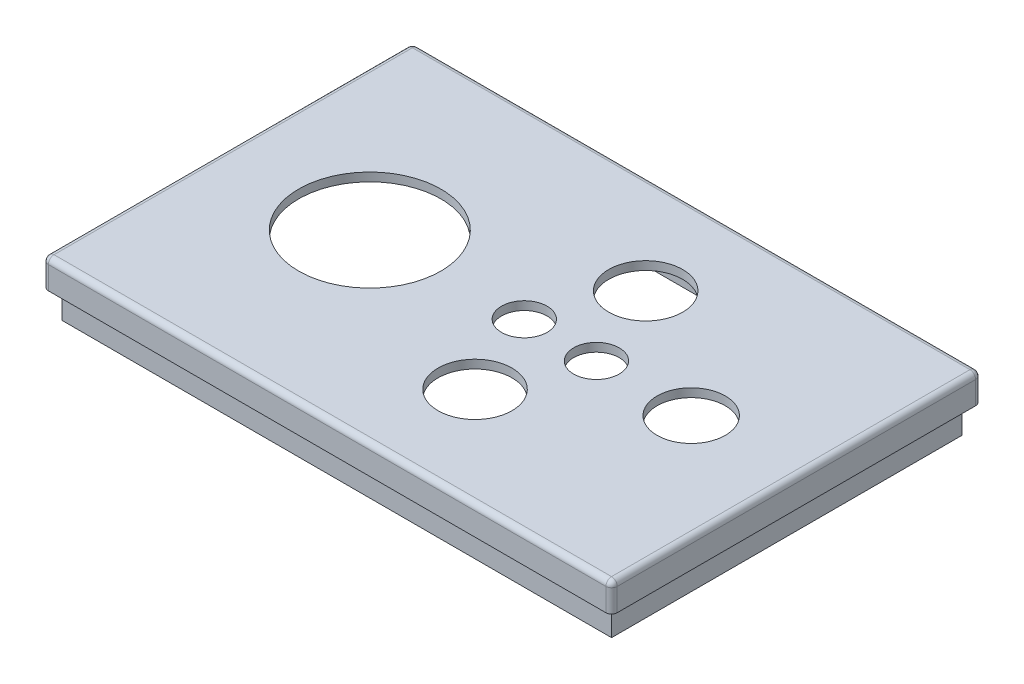
ISO-10303-21;
HEADER;
FILE_DESCRIPTION(('STEP AP214'),'2;1');
FILE_NAME('part.step','',(''),(''),'','','');
FILE_SCHEMA(('AUTOMOTIVE_DESIGN { 1 0 10303 214 1 1 1 1 }'));
ENDSEC;
DATA;
#1=APPLICATION_CONTEXT('core data for automotive mechanical design processes');
#2=APPLICATION_PROTOCOL_DEFINITION('international standard','automotive_design',2000,#1);
#3=PRODUCT_CONTEXT('',#1,'mechanical');
#4=PRODUCT('Part','Part','',(#3));
#5=PRODUCT_RELATED_PRODUCT_CATEGORY('part','',(#4));
#6=PRODUCT_DEFINITION_FORMATION('','',#4);
#7=PRODUCT_DEFINITION_CONTEXT('part definition',#1,'design');
#8=PRODUCT_DEFINITION('design','',#6,#7);
#9=PRODUCT_DEFINITION_SHAPE('','',#8);
#10=(LENGTH_UNIT() NAMED_UNIT(*) SI_UNIT(.MILLI.,.METRE.));
#11=(NAMED_UNIT(*) PLANE_ANGLE_UNIT() SI_UNIT($,.RADIAN.));
#12=(NAMED_UNIT(*) SI_UNIT($,.STERADIAN.) SOLID_ANGLE_UNIT());
#13=UNCERTAINTY_MEASURE_WITH_UNIT(LENGTH_MEASURE(1.E-05),#10,'distance_accuracy_value','');
#14=(GEOMETRIC_REPRESENTATION_CONTEXT(3) GLOBAL_UNCERTAINTY_ASSIGNED_CONTEXT((#13)) GLOBAL_UNIT_ASSIGNED_CONTEXT((#10,
#11,#12)) REPRESENTATION_CONTEXT('',''));
#15=CARTESIAN_POINT('',(0.,0.,0.));
#16=DIRECTION('',(0.,0.,1.));
#17=DIRECTION('',(1.,0.,0.));
#18=AXIS2_PLACEMENT_3D('',#15,#16,#17);
#19=CARTESIAN_POINT('',(0.,75.,0.));
#20=DIRECTION('',(0.,1.,0.));
#21=DIRECTION('',(0.,0.,1.));
#22=AXIS2_PLACEMENT_3D('',#19,#20,#21);
#23=PLANE('',#22);
#24=DIRECTION('',(-1.,0.,0.));
#25=VECTOR('',#24,1.);
#26=CARTESIAN_POINT('',(-47.0604562737643,75.,-41.1555133079848));
#27=LINE('',#26,#25);
#28=CARTESIAN_POINT('',(49.5395437262358,75.,-41.1555133079848));
#29=VERTEX_POINT('',#28);
#30=CARTESIAN_POINT('',(-47.0604562737643,75.,-41.1555133079848));
#31=VERTEX_POINT('',#30);
#32=EDGE_CURVE('E201',#29,#31,#27,.T.);
#33=ORIENTED_EDGE('',*,*,#32,.T.);
#34=DIRECTION('',(0.,0.,1.));
#35=VECTOR('',#34,1.);
#36=CARTESIAN_POINT('',(-47.0604562737643,75.,-41.1555133079848));
#37=LINE('',#36,#35);
#38=CARTESIAN_POINT('',(-47.0604562737643,75.,20.4444866920152));
#39=VERTEX_POINT('',#38);
#40=EDGE_CURVE('E49',#31,#39,#37,.T.);
#41=ORIENTED_EDGE('',*,*,#40,.T.);
#42=DIRECTION('',(1.,0.,0.));
#43=VECTOR('',#42,1.);
#44=CARTESIAN_POINT('',(-47.0604562737643,75.,20.4444866920152));
#45=LINE('',#44,#43);
#46=CARTESIAN_POINT('',(49.5395437262358,75.,20.4444866920152));
#47=VERTEX_POINT('',#46);
#48=EDGE_CURVE('E212',#39,#47,#45,.T.);
#49=ORIENTED_EDGE('',*,*,#48,.T.);
#50=DIRECTION('',(0.,0.,-1.));
#51=VECTOR('',#50,1.);
#52=CARTESIAN_POINT('',(49.5395437262358,75.,-41.1555133079848));
#53=LINE('',#52,#51);
#54=EDGE_CURVE('E215',#47,#29,#53,.T.);
#55=ORIENTED_EDGE('',*,*,#54,.T.);
#56=EDGE_LOOP('',(#33,#41,#49,#55));
#57=FACE_BOUND('',#56,.T.);
#58=CARTESIAN_POINT('',(-47.7604562737643,75.,21.1444866920152));
#59=DIRECTION('',(0.,1.,0.));
#60=DIRECTION('',(0.,0.,1.));
#61=AXIS2_PLACEMENT_3D('',#58,#59,#60);
#62=CIRCLE('',#61,1.);
#63=CARTESIAN_POINT('',(-47.7604562737643,75.,22.1444866920152));
#64=VERTEX_POINT('',#63);
#65=CARTESIAN_POINT('',(-48.7604562737643,75.,21.1444866920152));
#66=VERTEX_POINT('',#65);
#67=EDGE_CURVE('E36',#64,#66,#62,.F.);
#68=ORIENTED_EDGE('',*,*,#67,.T.);
#69=DIRECTION('',(0.,0.,1.));
#70=VECTOR('',#69,1.);
#71=CARTESIAN_POINT('',(-48.7604562737643,75.,-42.8555133079848));
#72=LINE('',#71,#70);
#73=CARTESIAN_POINT('',(-48.7604562737643,75.,-41.8555133079848));
#74=VERTEX_POINT('',#73);
#75=EDGE_CURVE('E338',#74,#66,#72,.T.);
#76=ORIENTED_EDGE('',*,*,#75,.F.);
#77=CARTESIAN_POINT('',(-47.7604562737643,75.,-41.8555133079848));
#78=DIRECTION('',(0.,1.,0.));
#79=DIRECTION('',(0.,0.,1.));
#80=AXIS2_PLACEMENT_3D('',#77,#78,#79);
#81=CIRCLE('',#80,1.);
#82=CARTESIAN_POINT('',(-47.7604562737643,75.,-42.8555133079848));
#83=VERTEX_POINT('',#82);
#84=EDGE_CURVE('E341',#74,#83,#81,.F.);
#85=ORIENTED_EDGE('',*,*,#84,.T.);
#86=DIRECTION('',(-1.,0.,0.));
#87=VECTOR('',#86,1.);
#88=CARTESIAN_POINT('',(-48.7604562737643,75.,-42.8555133079848));
#89=LINE('',#88,#87);
#90=CARTESIAN_POINT('',(50.2395437262357,75.,-42.8555133079848));
#91=VERTEX_POINT('',#90);
#92=EDGE_CURVE('E302',#91,#83,#89,.T.);
#93=ORIENTED_EDGE('',*,*,#92,.F.);
#94=CARTESIAN_POINT('',(50.2395437262357,75.,-41.8555133079848));
#95=DIRECTION('',(0.,1.,0.));
#96=DIRECTION('',(0.,0.,1.));
#97=AXIS2_PLACEMENT_3D('',#94,#95,#96);
#98=CIRCLE('',#97,1.);
#99=CARTESIAN_POINT('',(51.2395437262357,75.,-41.8555133079848));
#100=VERTEX_POINT('',#99);
#101=EDGE_CURVE('E11',#91,#100,#98,.F.);
#102=ORIENTED_EDGE('',*,*,#101,.T.);
#103=DIRECTION('',(0.,0.,-1.));
#104=VECTOR('',#103,1.);
#105=CARTESIAN_POINT('',(51.2395437262357,75.,-42.8555133079848));
#106=LINE('',#105,#104);
#107=CARTESIAN_POINT('',(51.2395437262358,75.,21.1444866920152));
#108=VERTEX_POINT('',#107);
#109=EDGE_CURVE('E336',#108,#100,#106,.T.);
#110=ORIENTED_EDGE('',*,*,#109,.F.);
#111=CARTESIAN_POINT('',(50.2395437262358,75.,21.1444866920152));
#112=DIRECTION('',(0.,1.,0.));
#113=DIRECTION('',(0.,0.,1.));
#114=AXIS2_PLACEMENT_3D('',#111,#112,#113);
#115=CIRCLE('',#114,1.);
#116=CARTESIAN_POINT('',(50.2395437262358,75.,22.1444866920152));
#117=VERTEX_POINT('',#116);
#118=EDGE_CURVE('E41',#108,#117,#115,.F.);
#119=ORIENTED_EDGE('',*,*,#118,.T.);
#120=DIRECTION('',(1.,0.,0.));
#121=VECTOR('',#120,1.);
#122=CARTESIAN_POINT('',(-48.7604562737643,75.,22.1444866920152));
#123=LINE('',#122,#121);
#124=EDGE_CURVE('E344',#64,#117,#123,.T.);
#125=ORIENTED_EDGE('',*,*,#124,.F.);
#126=EDGE_LOOP('',(#68,#76,#85,#93,#102,#110,#119,#125));
#127=FACE_BOUND('',#126,.T.);
#128=ADVANCED_FACE('F33',(#57,#127),#23,.F.);
#129=CARTESIAN_POINT('',(-48.7604562737643,80.,22.1444866920152));
#130=DIRECTION('',(0.,0.,-1.));
#131=DIRECTION('',(-1.,0.,0.));
#132=AXIS2_PLACEMENT_3D('',#129,#130,#131);
#133=PLANE('',#132);
#134=DIRECTION('',(0.,-1.,0.));
#135=VECTOR('',#134,1.);
#136=CARTESIAN_POINT('',(-47.7604562737643,80.,22.1444866920152));
#137=LINE('',#136,#135);
#138=CARTESIAN_POINT('',(-47.7604562737643,79.,22.1444866920152));
#139=VERTEX_POINT('',#138);
#140=EDGE_CURVE('E295',#139,#64,#137,.T.);
#141=ORIENTED_EDGE('',*,*,#140,.T.);
#142=ORIENTED_EDGE('',*,*,#124,.T.);
#143=DIRECTION('',(0.,-1.,0.));
#144=VECTOR('',#143,1.);
#145=CARTESIAN_POINT('',(50.2395437262358,80.,22.1444866920152));
#146=LINE('',#145,#144);
#147=CARTESIAN_POINT('',(50.2395437262358,79.,22.1444866920152));
#148=VERTEX_POINT('',#147);
#149=EDGE_CURVE('E300',#117,#148,#146,.F.);
#150=ORIENTED_EDGE('',*,*,#149,.T.);
#151=DIRECTION('',(1.,0.,0.));
#152=VECTOR('',#151,1.);
#153=CARTESIAN_POINT('',(-48.7604562737643,79.,22.1444866920152));
#154=LINE('',#153,#152);
#155=EDGE_CURVE('E298',#148,#139,#154,.F.);
#156=ORIENTED_EDGE('',*,*,#155,.T.);
#157=EDGE_LOOP('',(#141,#142,#150,#156));
#158=FACE_BOUND('',#157,.T.);
#159=ADVANCED_FACE('F398',(#158),#133,.F.);
#160=CARTESIAN_POINT('',(0.,80.,0.));
#161=DIRECTION('',(0.,1.,0.));
#162=DIRECTION('',(0.,0.,1.));
#163=AXIS2_PLACEMENT_3D('',#160,#161,#162);
#164=PLANE('',#163);
#165=CARTESIAN_POINT('',(3.39954372623574,80.,-10.3555133079848));
#166=DIRECTION('',(0.,1.,0.));
#167=DIRECTION('',(0.,0.,1.));
#168=AXIS2_PLACEMENT_3D('',#165,#166,#167);
#169=CIRCLE('',#168,4.);
#170=CARTESIAN_POINT('',(3.39954372623574,80.,-6.35551330798478));
#171=VERTEX_POINT('',#170);
#172=EDGE_CURVE('E189',#171,#171,#169,.T.);
#173=ORIENTED_EDGE('',*,*,#172,.F.);
#174=EDGE_LOOP('',(#173));
#175=FACE_BOUND('',#174,.T.);
#176=CARTESIAN_POINT('',(16.0795437262358,80.,-10.3555133079848));
#177=DIRECTION('',(0.,1.,0.));
#178=DIRECTION('',(0.,0.,1.));
#179=AXIS2_PLACEMENT_3D('',#176,#177,#178);
#180=CIRCLE('',#179,4.);
#181=CARTESIAN_POINT('',(16.0795437262358,80.,-6.35551330798479));
#182=VERTEX_POINT('',#181);
#183=EDGE_CURVE('E192',#182,#182,#180,.T.);
#184=ORIENTED_EDGE('',*,*,#183,.F.);
#185=EDGE_LOOP('',(#184));
#186=FACE_BOUND('',#185,.T.);
#187=CARTESIAN_POINT('',(9.73954372623576,80.,4.64448669201521));
#188=DIRECTION('',(0.,1.,0.));
#189=DIRECTION('',(0.,0.,1.));
#190=AXIS2_PLACEMENT_3D('',#187,#188,#189);
#191=CIRCLE('',#190,6.5);
#192=CARTESIAN_POINT('',(9.73954372623576,80.,11.1444866920152));
#193=VERTEX_POINT('',#192);
#194=EDGE_CURVE('E232',#193,#193,#191,.T.);
#195=ORIENTED_EDGE('',*,*,#194,.F.);
#196=EDGE_LOOP('',(#195));
#197=FACE_BOUND('',#196,.T.);
#198=CARTESIAN_POINT('',(9.73954372623576,80.,-25.3555133079848));
#199=DIRECTION('',(0.,1.,0.));
#200=DIRECTION('',(0.,0.,1.));
#201=AXIS2_PLACEMENT_3D('',#198,#199,#200);
#202=CIRCLE('',#201,6.5);
#203=CARTESIAN_POINT('',(9.73954372623576,80.,-18.8555133079848));
#204=VERTEX_POINT('',#203);
#205=EDGE_CURVE('E222',#204,#204,#202,.T.);
#206=ORIENTED_EDGE('',*,*,#205,.F.);
#207=EDGE_LOOP('',(#206));
#208=FACE_BOUND('',#207,.T.);
#209=CARTESIAN_POINT('',(-23.7604562737643,80.,-10.3555133079848));
#210=DIRECTION('',(0.,1.,0.));
#211=DIRECTION('',(0.,0.,1.));
#212=AXIS2_PLACEMENT_3D('',#209,#210,#211);
#213=CIRCLE('',#212,12.5);
#214=CARTESIAN_POINT('',(-23.7604562737643,80.,2.14448669201522));
#215=VERTEX_POINT('',#214);
#216=EDGE_CURVE('E244',#215,#215,#213,.T.);
#217=ORIENTED_EDGE('',*,*,#216,.F.);
#218=EDGE_LOOP('',(#217));
#219=FACE_BOUND('',#218,.T.);
#220=CARTESIAN_POINT('',(32.7395437262358,80.,-10.3555133079848));
#221=DIRECTION('',(0.,1.,0.));
#222=DIRECTION('',(0.,0.,1.));
#223=AXIS2_PLACEMENT_3D('',#220,#221,#222);
#224=CIRCLE('',#223,5.99999999999999);
#225=CARTESIAN_POINT('',(32.7395437262358,80.,-4.35551330798479));
#226=VERTEX_POINT('',#225);
#227=EDGE_CURVE('E231',#226,#226,#224,.T.);
#228=ORIENTED_EDGE('',*,*,#227,.F.);
#229=EDGE_LOOP('',(#228));
#230=FACE_BOUND('',#229,.T.);
#231=DIRECTION('',(1.,0.,0.));
#232=VECTOR('',#231,1.);
#233=CARTESIAN_POINT('',(51.2395437262358,80.,21.1444866920152));
#234=LINE('',#233,#232);
#235=CARTESIAN_POINT('',(-47.7604562737643,80.,21.1444866920152));
#236=VERTEX_POINT('',#235);
#237=CARTESIAN_POINT('',(50.2395437262358,80.,21.1444866920152));
#238=VERTEX_POINT('',#237);
#239=EDGE_CURVE('E260',#236,#238,#234,.T.);
#240=ORIENTED_EDGE('',*,*,#239,.T.);
#241=DIRECTION('',(0.,0.,-1.));
#242=VECTOR('',#241,1.);
#243=CARTESIAN_POINT('',(50.2395437262357,80.,-42.8555133079848));
#244=LINE('',#243,#242);
#245=CARTESIAN_POINT('',(50.2395437262357,80.,-41.8555133079848));
#246=VERTEX_POINT('',#245);
#247=EDGE_CURVE('E270',#238,#246,#244,.T.);
#248=ORIENTED_EDGE('',*,*,#247,.T.);
#249=DIRECTION('',(-1.,0.,0.));
#250=VECTOR('',#249,1.);
#251=CARTESIAN_POINT('',(-48.7604562737643,80.,-41.8555133079848));
#252=LINE('',#251,#250);
#253=CARTESIAN_POINT('',(-47.7604562737643,80.,-41.8555133079848));
#254=VERTEX_POINT('',#253);
#255=EDGE_CURVE('E268',#246,#254,#252,.T.);
#256=ORIENTED_EDGE('',*,*,#255,.T.);
#257=DIRECTION('',(0.,0.,1.));
#258=VECTOR('',#257,1.);
#259=CARTESIAN_POINT('',(-47.7604562737643,80.,22.1444866920152));
#260=LINE('',#259,#258);
#261=EDGE_CURVE('E266',#254,#236,#260,.T.);
#262=ORIENTED_EDGE('',*,*,#261,.T.);
#263=EDGE_LOOP('',(#240,#248,#256,#262));
#264=FACE_BOUND('',#263,.T.);
#265=ADVANCED_FACE('F419',(#175,#186,#197,#208,#219,#230,#264),#164,.T.);
#266=CARTESIAN_POINT('',(-48.7604562737643,80.,-42.8555133079848));
#267=DIRECTION('',(1.,0.,0.));
#268=DIRECTION('',(0.,0.,-1.));
#269=AXIS2_PLACEMENT_3D('',#266,#267,#268);
#270=PLANE('',#269);
#271=DIRECTION('',(0.,-1.,0.));
#272=VECTOR('',#271,1.);
#273=CARTESIAN_POINT('',(-48.7604562737643,80.,-41.8555133079848));
#274=LINE('',#273,#272);
#275=CARTESIAN_POINT('',(-48.7604562737643,79.,-41.8555133079848));
#276=VERTEX_POINT('',#275);
#277=EDGE_CURVE('E288',#276,#74,#274,.T.);
#278=ORIENTED_EDGE('',*,*,#277,.T.);
#279=ORIENTED_EDGE('',*,*,#75,.T.);
#280=DIRECTION('',(0.,-1.,0.));
#281=VECTOR('',#280,1.);
#282=CARTESIAN_POINT('',(-48.7604562737643,80.,21.1444866920152));
#283=LINE('',#282,#281);
#284=CARTESIAN_POINT('',(-48.7604562737643,79.,21.1444866920152));
#285=VERTEX_POINT('',#284);
#286=EDGE_CURVE('E293',#66,#285,#283,.F.);
#287=ORIENTED_EDGE('',*,*,#286,.T.);
#288=DIRECTION('',(0.,0.,1.));
#289=VECTOR('',#288,1.);
#290=CARTESIAN_POINT('',(-48.7604562737643,79.,-42.8555133079848));
#291=LINE('',#290,#289);
#292=EDGE_CURVE('E291',#285,#276,#291,.F.);
#293=ORIENTED_EDGE('',*,*,#292,.T.);
#294=EDGE_LOOP('',(#278,#279,#287,#293));
#295=FACE_BOUND('',#294,.T.);
#296=ADVANCED_FACE('F357',(#295),#270,.F.);
#297=CARTESIAN_POINT('',(51.2395437262357,80.,-42.8555133079848));
#298=DIRECTION('',(-1.,0.,0.));
#299=DIRECTION('',(0.,0.,1.));
#300=AXIS2_PLACEMENT_3D('',#297,#298,#299);
#301=PLANE('',#300);
#302=DIRECTION('',(0.,-1.,0.));
#303=VECTOR('',#302,1.);
#304=CARTESIAN_POINT('',(51.2395437262358,80.,21.1444866920152));
#305=LINE('',#304,#303);
#306=CARTESIAN_POINT('',(51.2395437262358,79.,21.1444866920152));
#307=VERTEX_POINT('',#306);
#308=EDGE_CURVE('E278',#307,#108,#305,.T.);
#309=ORIENTED_EDGE('',*,*,#308,.T.);
#310=ORIENTED_EDGE('',*,*,#109,.T.);
#311=DIRECTION('',(0.,-1.,0.));
#312=VECTOR('',#311,1.);
#313=CARTESIAN_POINT('',(51.2395437262357,80.,-41.8555133079848));
#314=LINE('',#313,#312);
#315=CARTESIAN_POINT('',(51.2395437262357,79.,-41.8555133079848));
#316=VERTEX_POINT('',#315);
#317=EDGE_CURVE('E273',#100,#316,#314,.F.);
#318=ORIENTED_EDGE('',*,*,#317,.T.);
#319=DIRECTION('',(0.,0.,-1.));
#320=VECTOR('',#319,1.);
#321=CARTESIAN_POINT('',(51.2395437262358,79.,22.1444866920152));
#322=LINE('',#321,#320);
#323=EDGE_CURVE('E275',#316,#307,#322,.F.);
#324=ORIENTED_EDGE('',*,*,#323,.T.);
#325=EDGE_LOOP('',(#309,#310,#318,#324));
#326=FACE_BOUND('',#325,.T.);
#327=ADVANCED_FACE('F391',(#326),#301,.F.);
#328=CARTESIAN_POINT('',(-48.7604562737643,80.,-42.8555133079848));
#329=DIRECTION('',(0.,0.,1.));
#330=DIRECTION('',(1.,0.,0.));
#331=AXIS2_PLACEMENT_3D('',#328,#329,#330);
#332=PLANE('',#331);
#333=DIRECTION('',(0.,-1.,0.));
#334=VECTOR('',#333,1.);
#335=CARTESIAN_POINT('',(50.2395437262357,80.,-42.8555133079848));
#336=LINE('',#335,#334);
#337=CARTESIAN_POINT('',(50.2395437262357,79.,-42.8555133079848));
#338=VERTEX_POINT('',#337);
#339=EDGE_CURVE('E281',#338,#91,#336,.T.);
#340=ORIENTED_EDGE('',*,*,#339,.T.);
#341=ORIENTED_EDGE('',*,*,#92,.T.);
#342=DIRECTION('',(0.,-1.,0.));
#343=VECTOR('',#342,1.);
#344=CARTESIAN_POINT('',(-47.7604562737643,80.,-42.8555133079848));
#345=LINE('',#344,#343);
#346=CARTESIAN_POINT('',(-47.7604562737643,79.,-42.8555133079848));
#347=VERTEX_POINT('',#346);
#348=EDGE_CURVE('E286',#83,#347,#345,.F.);
#349=ORIENTED_EDGE('',*,*,#348,.T.);
#350=DIRECTION('',(-1.,0.,0.));
#351=VECTOR('',#350,1.);
#352=CARTESIAN_POINT('',(51.2395437262357,79.,-42.8555133079848));
#353=LINE('',#352,#351);
#354=EDGE_CURVE('E284',#347,#338,#353,.F.);
#355=ORIENTED_EDGE('',*,*,#354,.T.);
#356=EDGE_LOOP('',(#340,#341,#349,#355));
#357=FACE_BOUND('',#356,.T.);
#358=ADVANCED_FACE('F375',(#357),#332,.F.);
#359=CARTESIAN_POINT('',(0.,78.5,0.));
#360=DIRECTION('',(0.,1.,0.));
#361=DIRECTION('',(0.,0.,1.));
#362=AXIS2_PLACEMENT_3D('',#359,#360,#361);
#363=PLANE('',#362);
#364=CARTESIAN_POINT('',(3.39954372623574,78.5,-10.3555133079848));
#365=DIRECTION('',(0.,1.,0.));
#366=DIRECTION('',(0.,0.,1.));
#367=AXIS2_PLACEMENT_3D('',#364,#365,#366);
#368=CIRCLE('',#367,4.);
#369=CARTESIAN_POINT('',(3.39954372623574,78.5,-6.35551330798478));
#370=VERTEX_POINT('',#369);
#371=EDGE_CURVE('E186',#370,#370,#368,.T.);
#372=ORIENTED_EDGE('',*,*,#371,.T.);
#373=EDGE_LOOP('',(#372));
#374=FACE_BOUND('',#373,.T.);
#375=CARTESIAN_POINT('',(16.0795437262358,78.5,-10.3555133079848));
#376=DIRECTION('',(0.,1.,0.));
#377=DIRECTION('',(0.,0.,1.));
#378=AXIS2_PLACEMENT_3D('',#375,#376,#377);
#379=CIRCLE('',#378,4.);
#380=CARTESIAN_POINT('',(16.0795437262358,78.5,-6.35551330798479));
#381=VERTEX_POINT('',#380);
#382=EDGE_CURVE('E634',#381,#381,#379,.T.);
#383=ORIENTED_EDGE('',*,*,#382,.T.);
#384=EDGE_LOOP('',(#383));
#385=FACE_BOUND('',#384,.T.);
#386=CARTESIAN_POINT('',(9.73954372623576,78.5,4.64448669201521));
#387=DIRECTION('',(0.,1.,0.));
#388=DIRECTION('',(0.,0.,1.));
#389=AXIS2_PLACEMENT_3D('',#386,#387,#388);
#390=CIRCLE('',#389,6.5);
#391=CARTESIAN_POINT('',(9.73954372623576,78.5,11.1444866920152));
#392=VERTEX_POINT('',#391);
#393=EDGE_CURVE('E228',#392,#392,#390,.T.);
#394=ORIENTED_EDGE('',*,*,#393,.T.);
#395=EDGE_LOOP('',(#394));
#396=FACE_BOUND('',#395,.T.);
#397=CARTESIAN_POINT('',(9.73954372623576,78.5,-25.3555133079848));
#398=DIRECTION('',(0.,1.,0.));
#399=DIRECTION('',(0.,0.,1.));
#400=AXIS2_PLACEMENT_3D('',#397,#398,#399);
#401=CIRCLE('',#400,6.5);
#402=CARTESIAN_POINT('',(9.73954372623576,78.5,-18.8555133079848));
#403=VERTEX_POINT('',#402);
#404=EDGE_CURVE('E235',#403,#403,#401,.T.);
#405=ORIENTED_EDGE('',*,*,#404,.T.);
#406=EDGE_LOOP('',(#405));
#407=FACE_BOUND('',#406,.T.);
#408=CARTESIAN_POINT('',(-23.7604562737643,78.5,-10.3555133079848));
#409=DIRECTION('',(0.,1.,0.));
#410=DIRECTION('',(0.,0.,1.));
#411=AXIS2_PLACEMENT_3D('',#408,#409,#410);
#412=CIRCLE('',#411,12.5);
#413=CARTESIAN_POINT('',(-23.7604562737643,78.5,2.14448669201522));
#414=VERTEX_POINT('',#413);
#415=EDGE_CURVE('E240',#414,#414,#412,.T.);
#416=ORIENTED_EDGE('',*,*,#415,.T.);
#417=EDGE_LOOP('',(#416));
#418=FACE_BOUND('',#417,.T.);
#419=CARTESIAN_POINT('',(32.7395437262358,78.5,-10.3555133079848));
#420=DIRECTION('',(0.,1.,0.));
#421=DIRECTION('',(0.,0.,1.));
#422=AXIS2_PLACEMENT_3D('',#419,#420,#421);
#423=CIRCLE('',#422,5.99999999999999);
#424=CARTESIAN_POINT('',(32.7395437262358,78.5,-4.35551330798479));
#425=VERTEX_POINT('',#424);
#426=EDGE_CURVE('E247',#425,#425,#423,.T.);
#427=ORIENTED_EDGE('',*,*,#426,.T.);
#428=EDGE_LOOP('',(#427));
#429=FACE_BOUND('',#428,.T.);
#430=DIRECTION('',(-1.,0.,0.));
#431=VECTOR('',#430,1.);
#432=CARTESIAN_POINT('',(47.5395437262358,78.5,18.4444866920152));
#433=LINE('',#432,#431);
#434=CARTESIAN_POINT('',(47.5395437262358,78.5,18.4444866920152));
#435=VERTEX_POINT('',#434);
#436=CARTESIAN_POINT('',(-45.0604562737642,78.5,18.4444866920152));
#437=VERTEX_POINT('',#436);
#438=EDGE_CURVE('E258',#435,#437,#433,.T.);
#439=ORIENTED_EDGE('',*,*,#438,.T.);
#440=DIRECTION('',(0.,0.,-1.));
#441=VECTOR('',#440,1.);
#442=CARTESIAN_POINT('',(-45.0604562737642,78.5,-39.1555133079848));
#443=LINE('',#442,#441);
#444=CARTESIAN_POINT('',(-45.0604562737642,78.5,-39.1555133079848));
#445=VERTEX_POINT('',#444);
#446=EDGE_CURVE('E167',#437,#445,#443,.T.);
#447=ORIENTED_EDGE('',*,*,#446,.T.);
#448=DIRECTION('',(1.,0.,0.));
#449=VECTOR('',#448,1.);
#450=CARTESIAN_POINT('',(47.5395437262358,78.5,-39.1555133079848));
#451=LINE('',#450,#449);
#452=CARTESIAN_POINT('',(47.5395437262358,78.5,-39.1555133079848));
#453=VERTEX_POINT('',#452);
#454=EDGE_CURVE('E262',#445,#453,#451,.T.);
#455=ORIENTED_EDGE('',*,*,#454,.T.);
#456=DIRECTION('',(0.,0.,1.));
#457=VECTOR('',#456,1.);
#458=CARTESIAN_POINT('',(47.5395437262358,78.5,-39.1555133079848));
#459=LINE('',#458,#457);
#460=EDGE_CURVE('E256',#453,#435,#459,.T.);
#461=ORIENTED_EDGE('',*,*,#460,.T.);
#462=EDGE_LOOP('',(#439,#447,#455,#461));
#463=FACE_BOUND('',#462,.T.);
#464=ADVANCED_FACE('F421',(#374,#385,#396,#407,#418,#429,#463),#363,.F.);
#465=CARTESIAN_POINT('',(47.5395437262358,80.002,-39.1555133079848));
#466=DIRECTION('',(1.,0.,0.));
#467=DIRECTION('',(0.,0.,-1.));
#468=AXIS2_PLACEMENT_3D('',#465,#466,#467);
#469=PLANE('',#468);
#470=DIRECTION('',(0.,-1.,0.));
#471=VECTOR('',#470,1.);
#472=CARTESIAN_POINT('',(47.5395437262358,80.002,-39.1555133079848));
#473=LINE('',#472,#471);
#474=CARTESIAN_POINT('',(47.5395437262358,70.,-39.1555133079848));
#475=VERTEX_POINT('',#474);
#476=EDGE_CURVE('E254',#453,#475,#473,.T.);
#477=ORIENTED_EDGE('',*,*,#476,.T.);
#478=DIRECTION('',(0.,0.,-1.));
#479=VECTOR('',#478,1.);
#480=CARTESIAN_POINT('',(47.5395437262358,70.,-41.1555133079848));
#481=LINE('',#480,#479);
#482=CARTESIAN_POINT('',(47.5395437262358,70.,18.4444866920152));
#483=VERTEX_POINT('',#482);
#484=EDGE_CURVE('E180',#483,#475,#481,.T.);
#485=ORIENTED_EDGE('',*,*,#484,.F.);
#486=DIRECTION('',(0.,-1.,0.));
#487=VECTOR('',#486,1.);
#488=CARTESIAN_POINT('',(47.5395437262358,80.002,18.4444866920152));
#489=LINE('',#488,#487);
#490=EDGE_CURVE('E171',#435,#483,#489,.T.);
#491=ORIENTED_EDGE('',*,*,#490,.F.);
#492=ORIENTED_EDGE('',*,*,#460,.F.);
#493=EDGE_LOOP('',(#477,#485,#491,#492));
#494=FACE_BOUND('',#493,.T.);
#495=ADVANCED_FACE('F447',(#494),#469,.F.);
#496=CARTESIAN_POINT('',(47.5395437262358,80.002,-39.1555133079848));
#497=DIRECTION('',(0.,0.,-1.));
#498=DIRECTION('',(-1.,0.,0.));
#499=AXIS2_PLACEMENT_3D('',#496,#497,#498);
#500=PLANE('',#499);
#501=DIRECTION('',(0.,-1.,0.));
#502=VECTOR('',#501,1.);
#503=CARTESIAN_POINT('',(-45.0604562737642,80.002,-39.1555133079848));
#504=LINE('',#503,#502);
#505=CARTESIAN_POINT('',(-45.0604562737643,70.,-39.1555133079848));
#506=VERTEX_POINT('',#505);
#507=EDGE_CURVE('E170',#445,#506,#504,.T.);
#508=ORIENTED_EDGE('',*,*,#507,.T.);
#509=DIRECTION('',(-1.,0.,0.));
#510=VECTOR('',#509,1.);
#511=CARTESIAN_POINT('',(-47.0604562737643,70.,-39.1555133079848));
#512=LINE('',#511,#510);
#513=EDGE_CURVE('E185',#475,#506,#512,.T.);
#514=ORIENTED_EDGE('',*,*,#513,.F.);
#515=ORIENTED_EDGE('',*,*,#476,.F.);
#516=ORIENTED_EDGE('',*,*,#454,.F.);
#517=EDGE_LOOP('',(#508,#514,#515,#516));
#518=FACE_BOUND('',#517,.T.);
#519=ADVANCED_FACE('F450',(#518),#500,.F.);
#520=CARTESIAN_POINT('',(-45.0604562737642,80.002,-39.1555133079848));
#521=DIRECTION('',(-1.,0.,0.));
#522=DIRECTION('',(0.,0.,1.));
#523=AXIS2_PLACEMENT_3D('',#520,#521,#522);
#524=PLANE('',#523);
#525=DIRECTION('',(0.,-1.,0.));
#526=VECTOR('',#525,1.);
#527=CARTESIAN_POINT('',(-45.0604562737642,80.002,18.4444866920152));
#528=LINE('',#527,#526);
#529=CARTESIAN_POINT('',(-45.0604562737643,70.,18.4444866920152));
#530=VERTEX_POINT('',#529);
#531=EDGE_CURVE('E160',#437,#530,#528,.T.);
#532=ORIENTED_EDGE('',*,*,#531,.T.);
#533=DIRECTION('',(0.,0.,1.));
#534=VECTOR('',#533,1.);
#535=CARTESIAN_POINT('',(-45.0604562737643,70.,-41.1555133079848));
#536=LINE('',#535,#534);
#537=EDGE_CURVE('E165',#506,#530,#536,.T.);
#538=ORIENTED_EDGE('',*,*,#537,.F.);
#539=ORIENTED_EDGE('',*,*,#507,.F.);
#540=ORIENTED_EDGE('',*,*,#446,.F.);
#541=EDGE_LOOP('',(#532,#538,#539,#540));
#542=FACE_BOUND('',#541,.T.);
#543=ADVANCED_FACE('F162',(#542),#524,.F.);
#544=CARTESIAN_POINT('',(47.5395437262358,80.002,18.4444866920152));
#545=DIRECTION('',(0.,0.,1.));
#546=DIRECTION('',(1.,0.,0.));
#547=AXIS2_PLACEMENT_3D('',#544,#545,#546);
#548=PLANE('',#547);
#549=ORIENTED_EDGE('',*,*,#490,.T.);
#550=DIRECTION('',(1.,0.,0.));
#551=VECTOR('',#550,1.);
#552=CARTESIAN_POINT('',(-47.0604562737643,70.,18.4444866920152));
#553=LINE('',#552,#551);
#554=EDGE_CURVE('E174',#530,#483,#553,.T.);
#555=ORIENTED_EDGE('',*,*,#554,.F.);
#556=ORIENTED_EDGE('',*,*,#531,.F.);
#557=ORIENTED_EDGE('',*,*,#438,.F.);
#558=EDGE_LOOP('',(#549,#555,#556,#557));
#559=FACE_BOUND('',#558,.T.);
#560=ADVANCED_FACE('F175',(#559),#548,.F.);
#561=CARTESIAN_POINT('',(-47.7604562737643,80.,21.1444866920152));
#562=DIRECTION('',(0.,-1.,0.));
#563=DIRECTION('',(0.,0.,-1.));
#564=AXIS2_PLACEMENT_3D('',#561,#562,#563);
#565=CYLINDRICAL_SURFACE('',#564,1.);
#566=ORIENTED_EDGE('',*,*,#67,.F.);
#567=ORIENTED_EDGE('',*,*,#140,.F.);
#568=CARTESIAN_POINT('',(-47.7604562737643,79.,21.1444866920152));
#569=DIRECTION('',(0.,1.,0.));
#570=DIRECTION('',(0.,0.,1.));
#571=AXIS2_PLACEMENT_3D('',#568,#569,#570);
#572=CIRCLE('',#571,1.);
#573=EDGE_CURVE('E252',#285,#139,#572,.T.);
#574=ORIENTED_EDGE('',*,*,#573,.F.);
#575=ORIENTED_EDGE('',*,*,#286,.F.);
#576=EDGE_LOOP('',(#566,#567,#574,#575));
#577=FACE_BOUND('',#576,.T.);
#578=ADVANCED_FACE('F354',(#577),#565,.T.);
#579=CARTESIAN_POINT('',(-47.7604562737643,79.,0.));
#580=DIRECTION('',(0.,0.,-1.));
#581=DIRECTION('',(-1.,0.,0.));
#582=AXIS2_PLACEMENT_3D('',#579,#580,#581);
#583=CYLINDRICAL_SURFACE('',#582,1.);
#584=CARTESIAN_POINT('',(-47.7604562737643,79.,-41.8555133079848));
#585=DIRECTION('',(0.,0.,-1.));
#586=DIRECTION('',(-1.,0.,0.));
#587=AXIS2_PLACEMENT_3D('',#584,#585,#586);
#588=CIRCLE('',#587,1.);
#589=EDGE_CURVE('E327',#276,#254,#588,.T.);
#590=ORIENTED_EDGE('',*,*,#589,.F.);
#591=ORIENTED_EDGE('',*,*,#292,.F.);
#592=CARTESIAN_POINT('',(-47.7604562737643,79.,21.1444866920152));
#593=DIRECTION('',(0.,0.,1.));
#594=DIRECTION('',(1.,0.,0.));
#595=AXIS2_PLACEMENT_3D('',#592,#593,#594);
#596=CIRCLE('',#595,1.);
#597=EDGE_CURVE('E330',#236,#285,#596,.T.);
#598=ORIENTED_EDGE('',*,*,#597,.F.);
#599=ORIENTED_EDGE('',*,*,#261,.F.);
#600=EDGE_LOOP('',(#590,#591,#598,#599));
#601=FACE_BOUND('',#600,.T.);
#602=ADVANCED_FACE('F362',(#601),#583,.T.);
#603=CARTESIAN_POINT('',(-47.7604562737643,80.,-41.8555133079848));
#604=DIRECTION('',(0.,-1.,0.));
#605=DIRECTION('',(0.,0.,-1.));
#606=AXIS2_PLACEMENT_3D('',#603,#604,#605);
#607=CYLINDRICAL_SURFACE('',#606,1.);
#608=ORIENTED_EDGE('',*,*,#84,.F.);
#609=ORIENTED_EDGE('',*,*,#277,.F.);
#610=CARTESIAN_POINT('',(-47.7604562737643,79.,-41.8555133079848));
#611=DIRECTION('',(0.,1.,0.));
#612=DIRECTION('',(0.,0.,1.));
#613=AXIS2_PLACEMENT_3D('',#610,#611,#612);
#614=CIRCLE('',#613,1.);
#615=EDGE_CURVE('E324',#347,#276,#614,.T.);
#616=ORIENTED_EDGE('',*,*,#615,.F.);
#617=ORIENTED_EDGE('',*,*,#348,.F.);
#618=EDGE_LOOP('',(#608,#609,#616,#617));
#619=FACE_BOUND('',#618,.T.);
#620=ADVANCED_FACE('F372',(#619),#607,.T.);
#621=CARTESIAN_POINT('',(-47.7604562737643,79.,21.1444866920152));
#622=DIRECTION('',(-1.,0.,0.));
#623=DIRECTION('',(0.,0.,1.));
#624=AXIS2_PLACEMENT_3D('',#621,#622,#623);
#625=SPHERICAL_SURFACE('',#624,1.);
#626=ORIENTED_EDGE('',*,*,#597,.T.);
#627=ORIENTED_EDGE('',*,*,#573,.T.);
#628=CARTESIAN_POINT('',(-47.7604562737643,79.,21.1444866920152));
#629=DIRECTION('',(-1.,0.,0.));
#630=DIRECTION('',(0.,0.,1.));
#631=AXIS2_PLACEMENT_3D('',#628,#629,#630);
#632=CIRCLE('',#631,1.);
#633=EDGE_CURVE('E321',#236,#139,#632,.F.);
#634=ORIENTED_EDGE('',*,*,#633,.F.);
#635=EDGE_LOOP('',(#626,#627,#634));
#636=FACE_BOUND('',#635,.T.);
#637=ADVANCED_FACE('F404',(#636),#625,.T.);
#638=CARTESIAN_POINT('',(-47.7604562737643,79.,-41.8555133079848));
#639=DIRECTION('',(-1.,0.,0.));
#640=DIRECTION('',(0.,0.,1.));
#641=AXIS2_PLACEMENT_3D('',#638,#639,#640);
#642=SPHERICAL_SURFACE('',#641,1.);
#643=ORIENTED_EDGE('',*,*,#615,.T.);
#644=ORIENTED_EDGE('',*,*,#589,.T.);
#645=CARTESIAN_POINT('',(-47.7604562737643,79.,-41.8555133079848));
#646=DIRECTION('',(-1.,0.,0.));
#647=DIRECTION('',(0.,0.,1.));
#648=AXIS2_PLACEMENT_3D('',#645,#646,#647);
#649=CIRCLE('',#648,1.);
#650=EDGE_CURVE('E318',#347,#254,#649,.F.);
#651=ORIENTED_EDGE('',*,*,#650,.F.);
#652=EDGE_LOOP('',(#643,#644,#651));
#653=FACE_BOUND('',#652,.T.);
#654=ADVANCED_FACE('F368',(#653),#642,.T.);
#655=CARTESIAN_POINT('',(50.2395437262358,80.,21.1444866920152));
#656=DIRECTION('',(0.,-1.,0.));
#657=DIRECTION('',(0.,0.,-1.));
#658=AXIS2_PLACEMENT_3D('',#655,#656,#657);
#659=CYLINDRICAL_SURFACE('',#658,1.);
#660=ORIENTED_EDGE('',*,*,#118,.F.);
#661=ORIENTED_EDGE('',*,*,#308,.F.);
#662=CARTESIAN_POINT('',(50.2395437262358,79.,21.1444866920152));
#663=DIRECTION('',(0.,1.,0.));
#664=DIRECTION('',(0.,0.,1.));
#665=AXIS2_PLACEMENT_3D('',#662,#663,#664);
#666=CIRCLE('',#665,1.);
#667=EDGE_CURVE('E315',#148,#307,#666,.T.);
#668=ORIENTED_EDGE('',*,*,#667,.F.);
#669=ORIENTED_EDGE('',*,*,#149,.F.);
#670=EDGE_LOOP('',(#660,#661,#668,#669));
#671=FACE_BOUND('',#670,.T.);
#672=ADVANCED_FACE('F396',(#671),#659,.T.);
#673=CARTESIAN_POINT('',(0.,79.,21.1444866920152));
#674=DIRECTION('',(-1.,0.,0.));
#675=DIRECTION('',(0.,0.,1.));
#676=AXIS2_PLACEMENT_3D('',#673,#674,#675);
#677=CYLINDRICAL_SURFACE('',#676,1.);
#678=ORIENTED_EDGE('',*,*,#633,.T.);
#679=ORIENTED_EDGE('',*,*,#155,.F.);
#680=CARTESIAN_POINT('',(50.2395437262358,79.,21.1444866920152));
#681=DIRECTION('',(1.,0.,0.));
#682=DIRECTION('',(0.,0.,-1.));
#683=AXIS2_PLACEMENT_3D('',#680,#681,#682);
#684=CIRCLE('',#683,1.);
#685=EDGE_CURVE('E312',#238,#148,#684,.T.);
#686=ORIENTED_EDGE('',*,*,#685,.F.);
#687=ORIENTED_EDGE('',*,*,#239,.F.);
#688=EDGE_LOOP('',(#678,#679,#686,#687));
#689=FACE_BOUND('',#688,.T.);
#690=ADVANCED_FACE('F401',(#689),#677,.T.);
#691=CARTESIAN_POINT('',(0.,79.,-41.8555133079848));
#692=DIRECTION('',(1.,0.,0.));
#693=DIRECTION('',(0.,0.,-1.));
#694=AXIS2_PLACEMENT_3D('',#691,#692,#693);
#695=CYLINDRICAL_SURFACE('',#694,1.);
#696=ORIENTED_EDGE('',*,*,#650,.T.);
#697=ORIENTED_EDGE('',*,*,#255,.F.);
#698=CARTESIAN_POINT('',(50.2395437262357,79.,-41.8555133079848));
#699=DIRECTION('',(1.,0.,0.));
#700=DIRECTION('',(0.,0.,-1.));
#701=AXIS2_PLACEMENT_3D('',#698,#699,#700);
#702=CIRCLE('',#701,1.);
#703=EDGE_CURVE('E309',#338,#246,#702,.T.);
#704=ORIENTED_EDGE('',*,*,#703,.F.);
#705=ORIENTED_EDGE('',*,*,#354,.F.);
#706=EDGE_LOOP('',(#696,#697,#704,#705));
#707=FACE_BOUND('',#706,.T.);
#708=ADVANCED_FACE('F382',(#707),#695,.T.);
#709=CARTESIAN_POINT('',(50.2395437262357,80.,-41.8555133079848));
#710=DIRECTION('',(0.,-1.,0.));
#711=DIRECTION('',(0.,0.,-1.));
#712=AXIS2_PLACEMENT_3D('',#709,#710,#711);
#713=CYLINDRICAL_SURFACE('',#712,1.);
#714=ORIENTED_EDGE('',*,*,#101,.F.);
#715=ORIENTED_EDGE('',*,*,#339,.F.);
#716=CARTESIAN_POINT('',(50.2395437262357,79.,-41.8555133079848));
#717=DIRECTION('',(0.,1.,0.));
#718=DIRECTION('',(0.,0.,1.));
#719=AXIS2_PLACEMENT_3D('',#716,#717,#718);
#720=CIRCLE('',#719,1.);
#721=EDGE_CURVE('E306',#316,#338,#720,.T.);
#722=ORIENTED_EDGE('',*,*,#721,.F.);
#723=ORIENTED_EDGE('',*,*,#317,.F.);
#724=EDGE_LOOP('',(#714,#715,#722,#723));
#725=FACE_BOUND('',#724,.T.);
#726=ADVANCED_FACE('F378',(#725),#713,.T.);
#727=CARTESIAN_POINT('',(50.2395437262358,79.,21.1444866920152));
#728=DIRECTION('',(0.,0.,1.));
#729=DIRECTION('',(1.,0.,0.));
#730=AXIS2_PLACEMENT_3D('',#727,#728,#729);
#731=SPHERICAL_SURFACE('',#730,1.);
#732=ORIENTED_EDGE('',*,*,#685,.T.);
#733=ORIENTED_EDGE('',*,*,#667,.T.);
#734=CARTESIAN_POINT('',(50.2395437262358,79.,21.1444866920152));
#735=DIRECTION('',(0.,0.,1.));
#736=DIRECTION('',(0.,-1.,0.));
#737=AXIS2_PLACEMENT_3D('',#734,#735,#736);
#738=CIRCLE('',#737,1.);
#739=EDGE_CURVE('E304',#238,#307,#738,.F.);
#740=ORIENTED_EDGE('',*,*,#739,.F.);
#741=EDGE_LOOP('',(#732,#733,#740));
#742=FACE_BOUND('',#741,.T.);
#743=ADVANCED_FACE('F475',(#742),#731,.T.);
#744=CARTESIAN_POINT('',(50.2395437262357,79.,-41.8555133079848));
#745=DIRECTION('',(0.,0.,-1.));
#746=DIRECTION('',(-1.,0.,0.));
#747=AXIS2_PLACEMENT_3D('',#744,#745,#746);
#748=SPHERICAL_SURFACE('',#747,1.);
#749=ORIENTED_EDGE('',*,*,#721,.T.);
#750=ORIENTED_EDGE('',*,*,#703,.T.);
#751=CARTESIAN_POINT('',(50.2395437262357,79.,-41.8555133079848));
#752=DIRECTION('',(0.,0.,-1.));
#753=DIRECTION('',(-1.,0.,0.));
#754=AXIS2_PLACEMENT_3D('',#751,#752,#753);
#755=CIRCLE('',#754,1.);
#756=EDGE_CURVE('E243',#316,#246,#755,.F.);
#757=ORIENTED_EDGE('',*,*,#756,.F.);
#758=EDGE_LOOP('',(#749,#750,#757));
#759=FACE_BOUND('',#758,.T.);
#760=ADVANCED_FACE('F385',(#759),#748,.T.);
#761=CARTESIAN_POINT('',(50.2395437262358,79.,0.));
#762=DIRECTION('',(0.,0.,1.));
#763=DIRECTION('',(1.,0.,0.));
#764=AXIS2_PLACEMENT_3D('',#761,#762,#763);
#765=CYLINDRICAL_SURFACE('',#764,1.);
#766=ORIENTED_EDGE('',*,*,#739,.T.);
#767=ORIENTED_EDGE('',*,*,#323,.F.);
#768=ORIENTED_EDGE('',*,*,#756,.T.);
#769=ORIENTED_EDGE('',*,*,#247,.F.);
#770=EDGE_LOOP('',(#766,#767,#768,#769));
#771=FACE_BOUND('',#770,.T.);
#772=ADVANCED_FACE('F388',(#771),#765,.T.);
#773=CARTESIAN_POINT('',(32.7395437262358,78.5,-10.3555133079848));
#774=DIRECTION('',(0.,1.,0.));
#775=DIRECTION('',(0.,0.,1.));
#776=AXIS2_PLACEMENT_3D('',#773,#774,#775);
#777=CYLINDRICAL_SURFACE('',#776,5.99999999999999);
#778=ORIENTED_EDGE('',*,*,#426,.F.);
#779=EDGE_LOOP('',(#778));
#780=FACE_BOUND('',#779,.T.);
#781=ORIENTED_EDGE('',*,*,#227,.T.);
#782=EDGE_LOOP('',(#781));
#783=FACE_BOUND('',#782,.T.);
#784=ADVANCED_FACE('F442',(#780,#783),#777,.F.);
#785=CARTESIAN_POINT('',(-23.7604562737643,78.5,-10.3555133079848));
#786=DIRECTION('',(0.,1.,0.));
#787=DIRECTION('',(0.,0.,1.));
#788=AXIS2_PLACEMENT_3D('',#785,#786,#787);
#789=CYLINDRICAL_SURFACE('',#788,12.5);
#790=ORIENTED_EDGE('',*,*,#415,.F.);
#791=EDGE_LOOP('',(#790));
#792=FACE_BOUND('',#791,.T.);
#793=ORIENTED_EDGE('',*,*,#216,.T.);
#794=EDGE_LOOP('',(#793));
#795=FACE_BOUND('',#794,.T.);
#796=ADVANCED_FACE('F433',(#792,#795),#789,.F.);
#797=CARTESIAN_POINT('',(9.73954372623576,78.5,-25.3555133079848));
#798=DIRECTION('',(0.,1.,0.));
#799=DIRECTION('',(0.,0.,1.));
#800=AXIS2_PLACEMENT_3D('',#797,#798,#799);
#801=CYLINDRICAL_SURFACE('',#800,6.5);
#802=ORIENTED_EDGE('',*,*,#404,.F.);
#803=EDGE_LOOP('',(#802));
#804=FACE_BOUND('',#803,.T.);
#805=ORIENTED_EDGE('',*,*,#205,.T.);
#806=EDGE_LOOP('',(#805));
#807=FACE_BOUND('',#806,.T.);
#808=ADVANCED_FACE('F424',(#804,#807),#801,.F.);
#809=CARTESIAN_POINT('',(9.73954372623576,78.5,4.64448669201521));
#810=DIRECTION('',(0.,1.,0.));
#811=DIRECTION('',(0.,0.,1.));
#812=AXIS2_PLACEMENT_3D('',#809,#810,#811);
#813=CYLINDRICAL_SURFACE('',#812,6.5);
#814=ORIENTED_EDGE('',*,*,#393,.F.);
#815=EDGE_LOOP('',(#814));
#816=FACE_BOUND('',#815,.T.);
#817=ORIENTED_EDGE('',*,*,#194,.T.);
#818=EDGE_LOOP('',(#817));
#819=FACE_BOUND('',#818,.T.);
#820=ADVANCED_FACE('F415',(#816,#819),#813,.F.);
#821=CARTESIAN_POINT('',(-47.0604562737643,70.,-41.1555133079848));
#822=DIRECTION('',(-1.,0.,0.));
#823=DIRECTION('',(0.,0.,1.));
#824=AXIS2_PLACEMENT_3D('',#821,#822,#823);
#825=PLANE('',#824);
#826=ORIENTED_EDGE('',*,*,#40,.F.);
#827=DIRECTION('',(0.,1.,0.));
#828=VECTOR('',#827,1.);
#829=CARTESIAN_POINT('',(-47.0604562737643,70.,-41.1555133079848));
#830=LINE('',#829,#828);
#831=CARTESIAN_POINT('',(-47.0604562737643,70.,-41.1555133079848));
#832=VERTEX_POINT('',#831);
#833=EDGE_CURVE('E220',#832,#31,#830,.T.);
#834=ORIENTED_EDGE('',*,*,#833,.F.);
#835=DIRECTION('',(0.,0.,1.));
#836=VECTOR('',#835,1.);
#837=CARTESIAN_POINT('',(-47.0604562737643,70.,-41.1555133079848));
#838=LINE('',#837,#836);
#839=CARTESIAN_POINT('',(-47.0604562737643,70.,20.4444866920152));
#840=VERTEX_POINT('',#839);
#841=EDGE_CURVE('E197',#832,#840,#838,.T.);
#842=ORIENTED_EDGE('',*,*,#841,.T.);
#843=DIRECTION('',(0.,1.,0.));
#844=VECTOR('',#843,1.);
#845=CARTESIAN_POINT('',(-47.0604562737643,70.,20.4444866920152));
#846=LINE('',#845,#844);
#847=EDGE_CURVE('E210',#840,#39,#846,.T.);
#848=ORIENTED_EDGE('',*,*,#847,.T.);
#849=EDGE_LOOP('',(#826,#834,#842,#848));
#850=FACE_BOUND('',#849,.T.);
#851=ADVANCED_FACE('F423',(#850),#825,.T.);
#852=CARTESIAN_POINT('',(-47.0604562737643,70.,-41.1555133079848));
#853=DIRECTION('',(0.,0.,-1.));
#854=DIRECTION('',(-1.,0.,0.));
#855=AXIS2_PLACEMENT_3D('',#852,#853,#854);
#856=PLANE('',#855);
#857=ORIENTED_EDGE('',*,*,#32,.F.);
#858=DIRECTION('',(0.,1.,0.));
#859=VECTOR('',#858,1.);
#860=CARTESIAN_POINT('',(49.5395437262358,70.,-41.1555133079848));
#861=LINE('',#860,#859);
#862=CARTESIAN_POINT('',(49.5395437262358,70.,-41.1555133079848));
#863=VERTEX_POINT('',#862);
#864=EDGE_CURVE('E223',#863,#29,#861,.T.);
#865=ORIENTED_EDGE('',*,*,#864,.F.);
#866=DIRECTION('',(-1.,0.,0.));
#867=VECTOR('',#866,1.);
#868=CARTESIAN_POINT('',(-47.0604562737643,70.,-41.1555133079848));
#869=LINE('',#868,#867);
#870=EDGE_CURVE('E207',#863,#832,#869,.T.);
#871=ORIENTED_EDGE('',*,*,#870,.T.);
#872=ORIENTED_EDGE('',*,*,#833,.T.);
#873=EDGE_LOOP('',(#857,#865,#871,#872));
#874=FACE_BOUND('',#873,.T.);
#875=ADVANCED_FACE('F431',(#874),#856,.T.);
#876=CARTESIAN_POINT('',(49.5395437262358,70.,-41.1555133079848));
#877=DIRECTION('',(1.,0.,0.));
#878=DIRECTION('',(0.,0.,-1.));
#879=AXIS2_PLACEMENT_3D('',#876,#877,#878);
#880=PLANE('',#879);
#881=ORIENTED_EDGE('',*,*,#54,.F.);
#882=DIRECTION('',(0.,1.,0.));
#883=VECTOR('',#882,1.);
#884=CARTESIAN_POINT('',(49.5395437262358,70.,20.4444866920152));
#885=LINE('',#884,#883);
#886=CARTESIAN_POINT('',(49.5395437262358,70.,20.4444866920152));
#887=VERTEX_POINT('',#886);
#888=EDGE_CURVE('E225',#887,#47,#885,.T.);
#889=ORIENTED_EDGE('',*,*,#888,.F.);
#890=DIRECTION('',(0.,0.,-1.));
#891=VECTOR('',#890,1.);
#892=CARTESIAN_POINT('',(49.5395437262358,70.,-41.1555133079848));
#893=LINE('',#892,#891);
#894=EDGE_CURVE('E204',#887,#863,#893,.T.);
#895=ORIENTED_EDGE('',*,*,#894,.T.);
#896=ORIENTED_EDGE('',*,*,#864,.T.);
#897=EDGE_LOOP('',(#881,#889,#895,#896));
#898=FACE_BOUND('',#897,.T.);
#899=ADVANCED_FACE('F556',(#898),#880,.T.);
#900=CARTESIAN_POINT('',(-47.0604562737643,70.,20.4444866920152));
#901=DIRECTION('',(0.,0.,1.));
#902=DIRECTION('',(1.,0.,0.));
#903=AXIS2_PLACEMENT_3D('',#900,#901,#902);
#904=PLANE('',#903);
#905=ORIENTED_EDGE('',*,*,#48,.F.);
#906=ORIENTED_EDGE('',*,*,#847,.F.);
#907=DIRECTION('',(1.,0.,0.));
#908=VECTOR('',#907,1.);
#909=CARTESIAN_POINT('',(-47.0604562737643,70.,20.4444866920152));
#910=LINE('',#909,#908);
#911=EDGE_CURVE('E200',#840,#887,#910,.T.);
#912=ORIENTED_EDGE('',*,*,#911,.T.);
#913=ORIENTED_EDGE('',*,*,#888,.T.);
#914=EDGE_LOOP('',(#905,#906,#912,#913));
#915=FACE_BOUND('',#914,.T.);
#916=ADVANCED_FACE('F567',(#915),#904,.T.);
#917=CARTESIAN_POINT('',(0.,70.,0.));
#918=DIRECTION('',(0.,1.,0.));
#919=DIRECTION('',(0.,0.,1.));
#920=AXIS2_PLACEMENT_3D('',#917,#918,#919);
#921=PLANE('',#920);
#922=ORIENTED_EDGE('',*,*,#513,.T.);
#923=ORIENTED_EDGE('',*,*,#537,.T.);
#924=ORIENTED_EDGE('',*,*,#554,.T.);
#925=ORIENTED_EDGE('',*,*,#484,.T.);
#926=EDGE_LOOP('',(#922,#923,#924,#925));
#927=FACE_BOUND('',#926,.T.);
#928=ORIENTED_EDGE('',*,*,#841,.F.);
#929=ORIENTED_EDGE('',*,*,#870,.F.);
#930=ORIENTED_EDGE('',*,*,#894,.F.);
#931=ORIENTED_EDGE('',*,*,#911,.F.);
#932=EDGE_LOOP('',(#928,#929,#930,#931));
#933=FACE_BOUND('',#932,.T.);
#934=ADVANCED_FACE('F182',(#927,#933),#921,.F.);
#935=CARTESIAN_POINT('',(16.0795437262358,78.5,-10.3555133079848));
#936=DIRECTION('',(0.,1.,0.));
#937=DIRECTION('',(0.,0.,1.));
#938=AXIS2_PLACEMENT_3D('',#935,#936,#937);
#939=CYLINDRICAL_SURFACE('',#938,4.);
#940=ORIENTED_EDGE('',*,*,#382,.F.);
#941=EDGE_LOOP('',(#940));
#942=FACE_BOUND('',#941,.T.);
#943=ORIENTED_EDGE('',*,*,#183,.T.);
#944=EDGE_LOOP('',(#943));
#945=FACE_BOUND('',#944,.T.);
#946=ADVANCED_FACE('F585',(#942,#945),#939,.F.);
#947=CARTESIAN_POINT('',(3.39954372623574,78.5,-10.3555133079848));
#948=DIRECTION('',(0.,1.,0.));
#949=DIRECTION('',(0.,0.,1.));
#950=AXIS2_PLACEMENT_3D('',#947,#948,#949);
#951=CYLINDRICAL_SURFACE('',#950,4.);
#952=ORIENTED_EDGE('',*,*,#371,.F.);
#953=EDGE_LOOP('',(#952));
#954=FACE_BOUND('',#953,.T.);
#955=ORIENTED_EDGE('',*,*,#172,.T.);
#956=EDGE_LOOP('',(#955));
#957=FACE_BOUND('',#956,.T.);
#958=ADVANCED_FACE('F615',(#954,#957),#951,.F.);
#959=CLOSED_SHELL('',(#128,#159,#265,#296,#327,#358,#464,#495,#519,#543,#560,#578,#602,#620,
#637,#654,#672,#690,#708,#726,#743,#760,#772,#784,#796,#808,#820,#851,#875,#899,#916,#934,#946,#958));
#960=MANIFOLD_SOLID_BREP('B2',#959);
#961=ADVANCED_BREP_SHAPE_REPRESENTATION('',(#18,#960),#14);
#962=SHAPE_DEFINITION_REPRESENTATION(#9,#961);
ENDSEC;
END-ISO-10303-21;
